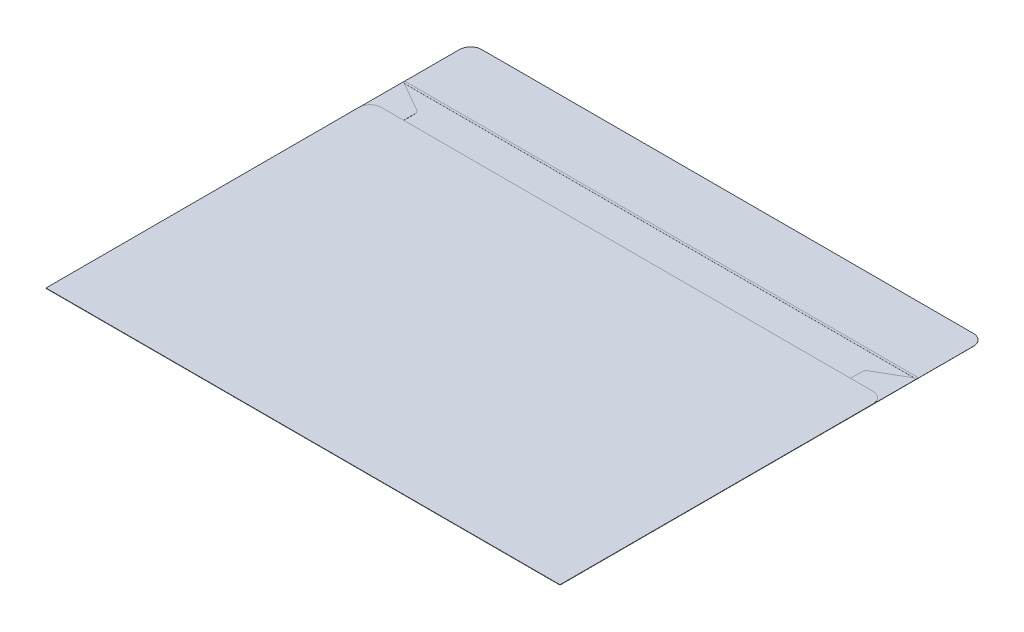
ISO-10303-21;
HEADER;
FILE_DESCRIPTION(('STEP AP214'),'2;1');
FILE_NAME('part.step','',(''),(''),'','','');
FILE_SCHEMA(('AUTOMOTIVE_DESIGN { 1 0 10303 214 1 1 1 1 }'));
ENDSEC;
DATA;
#1=APPLICATION_CONTEXT('core data for automotive mechanical design processes');
#2=APPLICATION_PROTOCOL_DEFINITION('international standard','automotive_design',2000,#1);
#3=PRODUCT_CONTEXT('',#1,'mechanical');
#4=PRODUCT('Part','Part','',(#3));
#5=PRODUCT_RELATED_PRODUCT_CATEGORY('part','',(#4));
#6=PRODUCT_DEFINITION_FORMATION('','',#4);
#7=PRODUCT_DEFINITION_CONTEXT('part definition',#1,'design');
#8=PRODUCT_DEFINITION('design','',#6,#7);
#9=PRODUCT_DEFINITION_SHAPE('','',#8);
#10=(LENGTH_UNIT() NAMED_UNIT(*) SI_UNIT(.MILLI.,.METRE.));
#11=(NAMED_UNIT(*) PLANE_ANGLE_UNIT() SI_UNIT($,.RADIAN.));
#12=(NAMED_UNIT(*) SI_UNIT($,.STERADIAN.) SOLID_ANGLE_UNIT());
#13=UNCERTAINTY_MEASURE_WITH_UNIT(LENGTH_MEASURE(1.E-05),#10,'distance_accuracy_value','');
#14=(GEOMETRIC_REPRESENTATION_CONTEXT(3) GLOBAL_UNCERTAINTY_ASSIGNED_CONTEXT((#13)) GLOBAL_UNIT_ASSIGNED_CONTEXT((#10,
#11,#12)) REPRESENTATION_CONTEXT('',''));
#15=CARTESIAN_POINT('',(0.,0.,0.));
#16=DIRECTION('',(0.,0.,1.));
#17=DIRECTION('',(1.,0.,0.));
#18=AXIS2_PLACEMENT_3D('',#15,#16,#17);
#19=CARTESIAN_POINT('',(-110.,0.05,-105.));
#20=DIRECTION('',(0.,1.,0.));
#21=DIRECTION('',(0.,0.,1.));
#22=AXIS2_PLACEMENT_3D('',#19,#20,#21);
#23=PLANE('',#22);
#24=DIRECTION('',(1.,0.,0.));
#25=VECTOR('',#24,1.);
#26=CARTESIAN_POINT('',(-110.,0.05,-79.5));
#27=LINE('',#26,#25);
#28=CARTESIAN_POINT('',(-114.133974596216,0.05,-79.5));
#29=VERTEX_POINT('',#28);
#30=CARTESIAN_POINT('',(114.133974596216,0.05,-79.5));
#31=VERTEX_POINT('',#30);
#32=EDGE_CURVE('E258',#29,#31,#27,.T.);
#33=ORIENTED_EDGE('',*,*,#32,.F.);
#34=DIRECTION('',(0.866025403784437,0.,0.500000000000004));
#35=VECTOR('',#34,1.);
#36=CARTESIAN_POINT('',(5.89101615137729,0.05,-10.2035392823942));
#37=LINE('',#36,#35);
#38=CARTESIAN_POINT('',(-101.,0.05,-71.9170962313452));
#39=VERTEX_POINT('',#38);
#40=EDGE_CURVE('E292',#29,#39,#37,.T.);
#41=ORIENTED_EDGE('',*,*,#40,.T.);
#42=CARTESIAN_POINT('',(-102.,0.05,-70.1850454237763));
#43=DIRECTION('',(0.,1.,0.));
#44=DIRECTION('',(0.,0.,1.));
#45=AXIS2_PLACEMENT_3D('',#42,#43,#44);
#46=CIRCLE('',#45,2.);
#47=CARTESIAN_POINT('',(-100.,0.05,-70.1850454237763));
#48=VERTEX_POINT('',#47);
#49=EDGE_CURVE('E11',#39,#48,#46,.F.);
#50=ORIENTED_EDGE('',*,*,#49,.T.);
#51=DIRECTION('',(0.,0.,1.));
#52=VECTOR('',#51,1.);
#53=CARTESIAN_POINT('',(-100.,0.05,0.));
#54=LINE('',#53,#52);
#55=CARTESIAN_POINT('',(-100.,0.05,-65.));
#56=VERTEX_POINT('',#55);
#57=EDGE_CURVE('E288',#48,#56,#54,.T.);
#58=ORIENTED_EDGE('',*,*,#57,.T.);
#59=DIRECTION('',(1.,0.,0.));
#60=VECTOR('',#59,1.);
#61=CARTESIAN_POINT('',(0.,0.05,-65.));
#62=LINE('',#61,#60);
#63=CARTESIAN_POINT('',(100.,0.05,-65.));
#64=VERTEX_POINT('',#63);
#65=EDGE_CURVE('E308',#56,#64,#62,.T.);
#66=ORIENTED_EDGE('',*,*,#65,.T.);
#67=DIRECTION('',(0.,0.,1.));
#68=VECTOR('',#67,1.);
#69=CARTESIAN_POINT('',(100.,0.05,0.));
#70=LINE('',#69,#68);
#71=CARTESIAN_POINT('',(100.,0.05,-70.1850454237763));
#72=VERTEX_POINT('',#71);
#73=EDGE_CURVE('E272',#72,#64,#70,.T.);
#74=ORIENTED_EDGE('',*,*,#73,.F.);
#75=CARTESIAN_POINT('',(102.,0.05,-70.1850454237763));
#76=DIRECTION('',(0.,1.,0.));
#77=DIRECTION('',(0.,0.,1.));
#78=AXIS2_PLACEMENT_3D('',#75,#76,#77);
#79=CIRCLE('',#78,2.);
#80=CARTESIAN_POINT('',(101.,0.05,-71.9170962313452));
#81=VERTEX_POINT('',#80);
#82=EDGE_CURVE('E43',#72,#81,#79,.F.);
#83=ORIENTED_EDGE('',*,*,#82,.T.);
#84=DIRECTION('',(-0.866025403784437,0.,0.500000000000003));
#85=VECTOR('',#84,1.);
#86=CARTESIAN_POINT('',(-5.89101615137737,0.05,-10.2035392823944));
#87=LINE('',#86,#85);
#88=EDGE_CURVE('E267',#31,#81,#87,.T.);
#89=ORIENTED_EDGE('',*,*,#88,.F.);
#90=EDGE_LOOP('',(#33,#41,#50,#58,#66,#74,#83,#89));
#91=FACE_BOUND('',#90,.T.);
#92=ADVANCED_FACE('F35',(#91),#23,.T.);
#93=CARTESIAN_POINT('',(-110.,0.,-105.));
#94=DIRECTION('',(0.,1.,0.));
#95=DIRECTION('',(0.,0.,1.));
#96=AXIS2_PLACEMENT_3D('',#93,#94,#95);
#97=PLANE('',#96);
#98=DIRECTION('',(0.,0.,1.));
#99=VECTOR('',#98,1.);
#100=CARTESIAN_POINT('',(-115.,0.,-80.));
#101=LINE('',#100,#99);
#102=CARTESIAN_POINT('',(-115.,0.,-79.5));
#103=VERTEX_POINT('',#102);
#104=CARTESIAN_POINT('',(-115.,0.,80.));
#105=VERTEX_POINT('',#104);
#106=EDGE_CURVE('E345',#103,#105,#101,.T.);
#107=ORIENTED_EDGE('',*,*,#106,.F.);
#108=DIRECTION('',(1.,0.,0.));
#109=VECTOR('',#108,1.);
#110=CARTESIAN_POINT('',(-110.,0.,-79.5));
#111=LINE('',#110,#109);
#112=CARTESIAN_POINT('',(115.,0.,-79.5));
#113=VERTEX_POINT('',#112);
#114=EDGE_CURVE('E262',#103,#113,#111,.T.);
#115=ORIENTED_EDGE('',*,*,#114,.T.);
#116=DIRECTION('',(0.,0.,-1.));
#117=VECTOR('',#116,1.);
#118=CARTESIAN_POINT('',(115.,0.,-80.));
#119=LINE('',#118,#117);
#120=CARTESIAN_POINT('',(115.,0.,80.));
#121=VERTEX_POINT('',#120);
#122=EDGE_CURVE('E335',#121,#113,#119,.T.);
#123=ORIENTED_EDGE('',*,*,#122,.F.);
#124=DIRECTION('',(1.,0.,0.));
#125=VECTOR('',#124,1.);
#126=CARTESIAN_POINT('',(-115.,0.,80.));
#127=LINE('',#126,#125);
#128=EDGE_CURVE('E325',#105,#121,#127,.T.);
#129=ORIENTED_EDGE('',*,*,#128,.F.);
#130=EDGE_LOOP('',(#107,#115,#123,#129));
#131=FACE_BOUND('',#130,.T.);
#132=ADVANCED_FACE('F467',(#131),#97,.F.);
#133=DIRECTION('',(-1.,0.,0.));
#134=VECTOR('',#133,1.);
#135=CARTESIAN_POINT('',(-110.,0.05,-80.5));
#136=LINE('',#135,#134);
#137=CARTESIAN_POINT('',(115.,0.05,-80.5));
#138=VERTEX_POINT('',#137);
#139=CARTESIAN_POINT('',(-115.,0.05,-80.5));
#140=VERTEX_POINT('',#139);
#141=EDGE_CURVE('E265',#138,#140,#136,.T.);
#142=ORIENTED_EDGE('',*,*,#141,.F.);
#143=DIRECTION('',(0.,0.,-1.));
#144=VECTOR('',#143,1.);
#145=CARTESIAN_POINT('',(115.,0.05,-80.));
#146=LINE('',#145,#144);
#147=CARTESIAN_POINT('',(115.,0.05,-105.));
#148=VERTEX_POINT('',#147);
#149=EDGE_CURVE('E213',#138,#148,#146,.T.);
#150=ORIENTED_EDGE('',*,*,#149,.T.);
#151=CARTESIAN_POINT('',(110.,0.05,-105.));
#152=DIRECTION('',(0.,1.,0.));
#153=DIRECTION('',(0.,0.,-1.));
#154=AXIS2_PLACEMENT_3D('',#151,#152,#153);
#155=CIRCLE('',#154,5.);
#156=CARTESIAN_POINT('',(110.,0.05,-110.));
#157=VERTEX_POINT('',#156);
#158=EDGE_CURVE('E324',#148,#157,#155,.T.);
#159=ORIENTED_EDGE('',*,*,#158,.T.);
#160=DIRECTION('',(-1.,0.,0.));
#161=VECTOR('',#160,1.);
#162=CARTESIAN_POINT('',(-110.,0.05,-110.));
#163=LINE('',#162,#161);
#164=CARTESIAN_POINT('',(-110.,0.05,-110.));
#165=VERTEX_POINT('',#164);
#166=EDGE_CURVE('E327',#157,#165,#163,.T.);
#167=ORIENTED_EDGE('',*,*,#166,.T.);
#168=CARTESIAN_POINT('',(-110.,0.05,-105.));
#169=DIRECTION('',(0.,1.,0.));
#170=DIRECTION('',(0.,0.,1.));
#171=AXIS2_PLACEMENT_3D('',#168,#169,#170);
#172=CIRCLE('',#171,5.);
#173=CARTESIAN_POINT('',(-115.,0.05,-105.));
#174=VERTEX_POINT('',#173);
#175=EDGE_CURVE('E329',#165,#174,#172,.T.);
#176=ORIENTED_EDGE('',*,*,#175,.T.);
#177=DIRECTION('',(0.,0.,1.));
#178=VECTOR('',#177,1.);
#179=CARTESIAN_POINT('',(-115.,0.05,-80.));
#180=LINE('',#179,#178);
#181=EDGE_CURVE('E331',#174,#140,#180,.T.);
#182=ORIENTED_EDGE('',*,*,#181,.T.);
#183=EDGE_LOOP('',(#142,#150,#159,#167,#176,#182));
#184=FACE_BOUND('',#183,.T.);
#185=ADVANCED_FACE('F494',(#184),#23,.T.);
#186=CARTESIAN_POINT('',(0.,0.15,-65.));
#187=DIRECTION('',(0.,0.,-1.));
#188=DIRECTION('',(-1.,0.,0.));
#189=AXIS2_PLACEMENT_3D('',#186,#187,#188);
#190=PLANE('',#189);
#191=DIRECTION('',(1.,0.,0.));
#192=VECTOR('',#191,1.);
#193=CARTESIAN_POINT('',(0.,0.15,-65.));
#194=LINE('',#193,#192);
#195=CARTESIAN_POINT('',(-110.,0.15,-65.));
#196=VERTEX_POINT('',#195);
#197=CARTESIAN_POINT('',(110.,0.15,-65.));
#198=VERTEX_POINT('',#197);
#199=EDGE_CURVE('E315',#196,#198,#194,.T.);
#200=ORIENTED_EDGE('',*,*,#199,.T.);
#201=DIRECTION('',(0.,-1.,0.));
#202=VECTOR('',#201,1.);
#203=CARTESIAN_POINT('',(110.,0.1,-65.));
#204=LINE('',#203,#202);
#205=CARTESIAN_POINT('',(110.,0.1,-65.));
#206=VERTEX_POINT('',#205);
#207=EDGE_CURVE('E377',#198,#206,#204,.T.);
#208=ORIENTED_EDGE('',*,*,#207,.T.);
#209=DIRECTION('',(1.,0.,0.));
#210=VECTOR('',#209,1.);
#211=CARTESIAN_POINT('',(0.,0.1,-65.));
#212=LINE('',#211,#210);
#213=CARTESIAN_POINT('',(100.,0.1,-65.));
#214=VERTEX_POINT('',#213);
#215=EDGE_CURVE('E277',#214,#206,#212,.T.);
#216=ORIENTED_EDGE('',*,*,#215,.F.);
#217=DIRECTION('',(0.,-1.,0.));
#218=VECTOR('',#217,1.);
#219=CARTESIAN_POINT('',(100.,0.1,-65.));
#220=LINE('',#219,#218);
#221=EDGE_CURVE('E280',#214,#64,#220,.T.);
#222=ORIENTED_EDGE('',*,*,#221,.T.);
#223=ORIENTED_EDGE('',*,*,#65,.F.);
#224=DIRECTION('',(0.,-1.,0.));
#225=VECTOR('',#224,1.);
#226=CARTESIAN_POINT('',(-100.,0.1,-65.));
#227=LINE('',#226,#225);
#228=CARTESIAN_POINT('',(-100.,0.1,-65.));
#229=VERTEX_POINT('',#228);
#230=EDGE_CURVE('E300',#229,#56,#227,.T.);
#231=ORIENTED_EDGE('',*,*,#230,.F.);
#232=DIRECTION('',(1.,0.,0.));
#233=VECTOR('',#232,1.);
#234=CARTESIAN_POINT('',(0.,0.1,-65.));
#235=LINE('',#234,#233);
#236=CARTESIAN_POINT('',(-110.,0.1,-65.));
#237=VERTEX_POINT('',#236);
#238=EDGE_CURVE('E297',#237,#229,#235,.T.);
#239=ORIENTED_EDGE('',*,*,#238,.F.);
#240=DIRECTION('',(0.,-1.,0.));
#241=VECTOR('',#240,1.);
#242=CARTESIAN_POINT('',(-110.,0.15,-65.));
#243=LINE('',#242,#241);
#244=EDGE_CURVE('E375',#237,#196,#243,.F.);
#245=ORIENTED_EDGE('',*,*,#244,.T.);
#246=EDGE_LOOP('',(#200,#208,#216,#222,#223,#231,#239,#245));
#247=FACE_BOUND('',#246,.T.);
#248=ADVANCED_FACE('F426',(#247),#190,.T.);
#249=CARTESIAN_POINT('',(115.,0.05,-80.));
#250=DIRECTION('',(-1.,0.,0.));
#251=DIRECTION('',(0.,0.,1.));
#252=AXIS2_PLACEMENT_3D('',#249,#250,#251);
#253=PLANE('',#252);
#254=DIRECTION('',(0.,0.,-1.));
#255=VECTOR('',#254,1.);
#256=CARTESIAN_POINT('',(115.,0.1,0.));
#257=LINE('',#256,#255);
#258=CARTESIAN_POINT('',(115.,0.1,-60.));
#259=VERTEX_POINT('',#258);
#260=CARTESIAN_POINT('',(115.,0.1,-80.));
#261=VERTEX_POINT('',#260);
#262=EDGE_CURVE('E268',#259,#261,#257,.T.);
#263=ORIENTED_EDGE('',*,*,#262,.F.);
#264=DIRECTION('',(0.,-1.,0.));
#265=VECTOR('',#264,1.);
#266=CARTESIAN_POINT('',(115.,0.15,-60.));
#267=LINE('',#266,#265);
#268=CARTESIAN_POINT('',(115.,0.15,-60.));
#269=VERTEX_POINT('',#268);
#270=EDGE_CURVE('E380',#259,#269,#267,.F.);
#271=ORIENTED_EDGE('',*,*,#270,.T.);
#272=DIRECTION('',(0.,0.,-1.));
#273=VECTOR('',#272,1.);
#274=CARTESIAN_POINT('',(115.,0.15,0.));
#275=LINE('',#274,#273);
#276=CARTESIAN_POINT('',(115.,0.15,80.));
#277=VERTEX_POINT('',#276);
#278=EDGE_CURVE('E312',#277,#269,#275,.T.);
#279=ORIENTED_EDGE('',*,*,#278,.F.);
#280=DIRECTION('',(0.,-1.,0.));
#281=VECTOR('',#280,1.);
#282=CARTESIAN_POINT('',(115.,0.05,80.));
#283=LINE('',#282,#281);
#284=EDGE_CURVE('E334',#277,#121,#283,.T.);
#285=ORIENTED_EDGE('',*,*,#284,.T.);
#286=ORIENTED_EDGE('',*,*,#122,.T.);
#287=DIRECTION('',(0.,1.,0.));
#288=VECTOR('',#287,1.);
#289=CARTESIAN_POINT('',(115.,-0.03,-79.5));
#290=LINE('',#289,#288);
#291=CARTESIAN_POINT('',(115.,-0.03,-79.5));
#292=VERTEX_POINT('',#291);
#293=EDGE_CURVE('E248',#292,#113,#290,.T.);
#294=ORIENTED_EDGE('',*,*,#293,.F.);
#295=DIRECTION('',(0.,0.,-1.));
#296=VECTOR('',#295,1.);
#297=CARTESIAN_POINT('',(115.,-0.03,-80.5));
#298=LINE('',#297,#296);
#299=CARTESIAN_POINT('',(115.,-0.03,-80.5));
#300=VERTEX_POINT('',#299);
#301=EDGE_CURVE('E237',#292,#300,#298,.T.);
#302=ORIENTED_EDGE('',*,*,#301,.T.);
#303=DIRECTION('',(0.,1.,0.));
#304=VECTOR('',#303,1.);
#305=CARTESIAN_POINT('',(115.,-0.03,-80.5));
#306=LINE('',#305,#304);
#307=CARTESIAN_POINT('',(115.,0.,-80.5));
#308=VERTEX_POINT('',#307);
#309=EDGE_CURVE('E217',#300,#308,#306,.T.);
#310=ORIENTED_EDGE('',*,*,#309,.T.);
#311=CARTESIAN_POINT('',(115.,0.,-105.));
#312=VERTEX_POINT('',#311);
#313=EDGE_CURVE('E320',#308,#312,#119,.T.);
#314=ORIENTED_EDGE('',*,*,#313,.T.);
#315=DIRECTION('',(0.,-1.,0.));
#316=VECTOR('',#315,1.);
#317=CARTESIAN_POINT('',(115.,0.05,-105.));
#318=LINE('',#317,#316);
#319=EDGE_CURVE('E365',#148,#312,#318,.T.);
#320=ORIENTED_EDGE('',*,*,#319,.F.);
#321=ORIENTED_EDGE('',*,*,#149,.F.);
#322=CARTESIAN_POINT('',(115.,0.08,-80.5));
#323=VERTEX_POINT('',#322);
#324=EDGE_CURVE('E206',#138,#323,#306,.T.);
#325=ORIENTED_EDGE('',*,*,#324,.T.);
#326=DIRECTION('',(0.,0.,-1.));
#327=VECTOR('',#326,1.);
#328=CARTESIAN_POINT('',(115.,0.08,-80.5));
#329=LINE('',#328,#327);
#330=CARTESIAN_POINT('',(115.,0.08,-80.));
#331=VERTEX_POINT('',#330);
#332=EDGE_CURVE('E210',#331,#323,#329,.T.);
#333=ORIENTED_EDGE('',*,*,#332,.F.);
#334=DIRECTION('',(0.,-1.,0.));
#335=VECTOR('',#334,1.);
#336=CARTESIAN_POINT('',(115.,0.1,-80.));
#337=LINE('',#336,#335);
#338=EDGE_CURVE('E286',#261,#331,#337,.T.);
#339=ORIENTED_EDGE('',*,*,#338,.F.);
#340=EDGE_LOOP('',(#263,#271,#279,#285,#286,#294,#302,#310,#314,#320,#321,#325,#333,#339));
#341=FACE_BOUND('',#340,.T.);
#342=ADVANCED_FACE('F208',(#341),#253,.F.);
#343=CARTESIAN_POINT('',(110.,0.05,-105.));
#344=DIRECTION('',(0.,-1.,0.));
#345=DIRECTION('',(0.,0.,-1.));
#346=AXIS2_PLACEMENT_3D('',#343,#344,#345);
#347=CYLINDRICAL_SURFACE('',#346,5.);
#348=CARTESIAN_POINT('',(110.,0.,-105.));
#349=DIRECTION('',(0.,1.,0.));
#350=DIRECTION('',(0.,0.,-1.));
#351=AXIS2_PLACEMENT_3D('',#348,#349,#350);
#352=CIRCLE('',#351,5.);
#353=CARTESIAN_POINT('',(110.,0.,-110.));
#354=VERTEX_POINT('',#353);
#355=EDGE_CURVE('E338',#312,#354,#352,.T.);
#356=ORIENTED_EDGE('',*,*,#355,.T.);
#357=DIRECTION('',(0.,-1.,0.));
#358=VECTOR('',#357,1.);
#359=CARTESIAN_POINT('',(110.,0.05,-110.));
#360=LINE('',#359,#358);
#361=EDGE_CURVE('E362',#157,#354,#360,.T.);
#362=ORIENTED_EDGE('',*,*,#361,.F.);
#363=ORIENTED_EDGE('',*,*,#158,.F.);
#364=ORIENTED_EDGE('',*,*,#319,.T.);
#365=EDGE_LOOP('',(#356,#362,#363,#364));
#366=FACE_BOUND('',#365,.T.);
#367=ADVANCED_FACE('F486',(#366),#347,.T.);
#368=CARTESIAN_POINT('',(-110.,0.05,-110.));
#369=DIRECTION('',(0.,0.,1.));
#370=DIRECTION('',(1.,0.,0.));
#371=AXIS2_PLACEMENT_3D('',#368,#369,#370);
#372=PLANE('',#371);
#373=DIRECTION('',(-1.,0.,0.));
#374=VECTOR('',#373,1.);
#375=CARTESIAN_POINT('',(-110.,0.,-110.));
#376=LINE('',#375,#374);
#377=CARTESIAN_POINT('',(-110.,0.,-110.));
#378=VERTEX_POINT('',#377);
#379=EDGE_CURVE('E340',#354,#378,#376,.T.);
#380=ORIENTED_EDGE('',*,*,#379,.T.);
#381=DIRECTION('',(0.,-1.,0.));
#382=VECTOR('',#381,1.);
#383=CARTESIAN_POINT('',(-110.,0.05,-110.));
#384=LINE('',#383,#382);
#385=EDGE_CURVE('E359',#165,#378,#384,.T.);
#386=ORIENTED_EDGE('',*,*,#385,.F.);
#387=ORIENTED_EDGE('',*,*,#166,.F.);
#388=ORIENTED_EDGE('',*,*,#361,.T.);
#389=EDGE_LOOP('',(#380,#386,#387,#388));
#390=FACE_BOUND('',#389,.T.);
#391=ADVANCED_FACE('F490',(#390),#372,.F.);
#392=CARTESIAN_POINT('',(-110.,0.05,-105.));
#393=DIRECTION('',(0.,-1.,0.));
#394=DIRECTION('',(0.,0.,-1.));
#395=AXIS2_PLACEMENT_3D('',#392,#393,#394);
#396=CYLINDRICAL_SURFACE('',#395,5.);
#397=CARTESIAN_POINT('',(-110.,0.,-105.));
#398=DIRECTION('',(0.,1.,0.));
#399=DIRECTION('',(0.,0.,1.));
#400=AXIS2_PLACEMENT_3D('',#397,#398,#399);
#401=CIRCLE('',#400,5.);
#402=CARTESIAN_POINT('',(-115.,0.,-105.));
#403=VERTEX_POINT('',#402);
#404=EDGE_CURVE('E342',#378,#403,#401,.T.);
#405=ORIENTED_EDGE('',*,*,#404,.T.);
#406=DIRECTION('',(0.,-1.,0.));
#407=VECTOR('',#406,1.);
#408=CARTESIAN_POINT('',(-115.,0.05,-105.));
#409=LINE('',#408,#407);
#410=EDGE_CURVE('E356',#174,#403,#409,.T.);
#411=ORIENTED_EDGE('',*,*,#410,.F.);
#412=ORIENTED_EDGE('',*,*,#175,.F.);
#413=ORIENTED_EDGE('',*,*,#385,.T.);
#414=EDGE_LOOP('',(#405,#411,#412,#413));
#415=FACE_BOUND('',#414,.T.);
#416=ADVANCED_FACE('F608',(#415),#396,.T.);
#417=CARTESIAN_POINT('',(-115.,0.05,-80.));
#418=DIRECTION('',(1.,0.,0.));
#419=DIRECTION('',(0.,0.,-1.));
#420=AXIS2_PLACEMENT_3D('',#417,#418,#419);
#421=PLANE('',#420);
#422=DIRECTION('',(0.,0.,1.));
#423=VECTOR('',#422,1.);
#424=CARTESIAN_POINT('',(-115.,0.15,0.));
#425=LINE('',#424,#423);
#426=CARTESIAN_POINT('',(-115.,0.15,-60.));
#427=VERTEX_POINT('',#426);
#428=CARTESIAN_POINT('',(-115.,0.15,80.));
#429=VERTEX_POINT('',#428);
#430=EDGE_CURVE('E318',#427,#429,#425,.T.);
#431=ORIENTED_EDGE('',*,*,#430,.F.);
#432=DIRECTION('',(0.,-1.,0.));
#433=VECTOR('',#432,1.);
#434=CARTESIAN_POINT('',(-115.,0.1,-60.));
#435=LINE('',#434,#433);
#436=CARTESIAN_POINT('',(-115.,0.1,-60.));
#437=VERTEX_POINT('',#436);
#438=EDGE_CURVE('E386',#427,#437,#435,.T.);
#439=ORIENTED_EDGE('',*,*,#438,.T.);
#440=DIRECTION('',(0.,0.,1.));
#441=VECTOR('',#440,1.);
#442=CARTESIAN_POINT('',(-115.,0.1,0.));
#443=LINE('',#442,#441);
#444=CARTESIAN_POINT('',(-115.,0.1,-80.));
#445=VERTEX_POINT('',#444);
#446=EDGE_CURVE('E295',#445,#437,#443,.T.);
#447=ORIENTED_EDGE('',*,*,#446,.F.);
#448=DIRECTION('',(0.,-1.,0.));
#449=VECTOR('',#448,1.);
#450=CARTESIAN_POINT('',(-115.,0.1,-80.));
#451=LINE('',#450,#449);
#452=CARTESIAN_POINT('',(-115.,0.08,-80.));
#453=VERTEX_POINT('',#452);
#454=EDGE_CURVE('E305',#445,#453,#451,.T.);
#455=ORIENTED_EDGE('',*,*,#454,.T.);
#456=DIRECTION('',(0.,0.,1.));
#457=VECTOR('',#456,1.);
#458=CARTESIAN_POINT('',(-115.,0.08,-80.5));
#459=LINE('',#458,#457);
#460=CARTESIAN_POINT('',(-115.,0.08,-80.5));
#461=VERTEX_POINT('',#460);
#462=EDGE_CURVE('E231',#461,#453,#459,.T.);
#463=ORIENTED_EDGE('',*,*,#462,.F.);
#464=DIRECTION('',(0.,1.,0.));
#465=VECTOR('',#464,1.);
#466=CARTESIAN_POINT('',(-115.,-0.03,-80.5));
#467=LINE('',#466,#465);
#468=EDGE_CURVE('E230',#140,#461,#467,.T.);
#469=ORIENTED_EDGE('',*,*,#468,.F.);
#470=ORIENTED_EDGE('',*,*,#181,.F.);
#471=ORIENTED_EDGE('',*,*,#410,.T.);
#472=CARTESIAN_POINT('',(-115.,0.,-80.5));
#473=VERTEX_POINT('',#472);
#474=EDGE_CURVE('E346',#403,#473,#101,.T.);
#475=ORIENTED_EDGE('',*,*,#474,.T.);
#476=CARTESIAN_POINT('',(-115.,-0.03,-80.5));
#477=VERTEX_POINT('',#476);
#478=EDGE_CURVE('E254',#477,#473,#467,.T.);
#479=ORIENTED_EDGE('',*,*,#478,.F.);
#480=DIRECTION('',(0.,0.,1.));
#481=VECTOR('',#480,1.);
#482=CARTESIAN_POINT('',(-115.,-0.03,-80.5));
#483=LINE('',#482,#481);
#484=CARTESIAN_POINT('',(-115.,-0.03,-79.5));
#485=VERTEX_POINT('',#484);
#486=EDGE_CURVE('E243',#477,#485,#483,.T.);
#487=ORIENTED_EDGE('',*,*,#486,.T.);
#488=DIRECTION('',(0.,1.,0.));
#489=VECTOR('',#488,1.);
#490=CARTESIAN_POINT('',(-115.,-0.03,-79.5));
#491=LINE('',#490,#489);
#492=EDGE_CURVE('E251',#485,#103,#491,.T.);
#493=ORIENTED_EDGE('',*,*,#492,.T.);
#494=ORIENTED_EDGE('',*,*,#106,.T.);
#495=DIRECTION('',(0.,-1.,0.));
#496=VECTOR('',#495,1.);
#497=CARTESIAN_POINT('',(-115.,0.05,80.));
#498=LINE('',#497,#496);
#499=EDGE_CURVE('E353',#429,#105,#498,.T.);
#500=ORIENTED_EDGE('',*,*,#499,.F.);
#501=EDGE_LOOP('',(#431,#439,#447,#455,#463,#469,#470,#471,#475,#479,#487,#493,#494,#500));
#502=FACE_BOUND('',#501,.T.);
#503=ADVANCED_FACE('F443',(#502),#421,.F.);
#504=CARTESIAN_POINT('',(-115.,0.05,80.));
#505=DIRECTION('',(0.,0.,-1.));
#506=DIRECTION('',(-1.,0.,0.));
#507=AXIS2_PLACEMENT_3D('',#504,#505,#506);
#508=PLANE('',#507);
#509=ORIENTED_EDGE('',*,*,#128,.T.);
#510=ORIENTED_EDGE('',*,*,#284,.F.);
#511=DIRECTION('',(1.,0.,0.));
#512=VECTOR('',#511,1.);
#513=CARTESIAN_POINT('',(0.,0.15,80.));
#514=LINE('',#513,#512);
#515=EDGE_CURVE('E309',#429,#277,#514,.T.);
#516=ORIENTED_EDGE('',*,*,#515,.F.);
#517=ORIENTED_EDGE('',*,*,#499,.T.);
#518=EDGE_LOOP('',(#509,#510,#516,#517));
#519=FACE_BOUND('',#518,.T.);
#520=ADVANCED_FACE('F463',(#519),#508,.F.);
#521=ORIENTED_EDGE('',*,*,#313,.F.);
#522=DIRECTION('',(-1.,0.,0.));
#523=VECTOR('',#522,1.);
#524=CARTESIAN_POINT('',(-110.,0.,-80.5));
#525=LINE('',#524,#523);
#526=EDGE_CURVE('E372',#308,#473,#525,.T.);
#527=ORIENTED_EDGE('',*,*,#526,.T.);
#528=ORIENTED_EDGE('',*,*,#474,.F.);
#529=ORIENTED_EDGE('',*,*,#404,.F.);
#530=ORIENTED_EDGE('',*,*,#379,.F.);
#531=ORIENTED_EDGE('',*,*,#355,.F.);
#532=EDGE_LOOP('',(#521,#527,#528,#529,#530,#531));
#533=FACE_BOUND('',#532,.T.);
#534=ADVANCED_FACE('F481',(#533),#97,.F.);
#535=CARTESIAN_POINT('',(0.,0.15,0.));
#536=DIRECTION('',(0.,1.,0.));
#537=DIRECTION('',(0.,0.,1.));
#538=AXIS2_PLACEMENT_3D('',#535,#536,#537);
#539=PLANE('',#538);
#540=ORIENTED_EDGE('',*,*,#278,.T.);
#541=CARTESIAN_POINT('',(110.,0.15,-60.));
#542=DIRECTION('',(0.,1.,0.));
#543=DIRECTION('',(0.,0.,1.));
#544=AXIS2_PLACEMENT_3D('',#541,#542,#543);
#545=CIRCLE('',#544,5.);
#546=EDGE_CURVE('E384',#269,#198,#545,.T.);
#547=ORIENTED_EDGE('',*,*,#546,.T.);
#548=ORIENTED_EDGE('',*,*,#199,.F.);
#549=CARTESIAN_POINT('',(-110.,0.15,-60.));
#550=DIRECTION('',(0.,1.,0.));
#551=DIRECTION('',(0.,0.,1.));
#552=AXIS2_PLACEMENT_3D('',#549,#550,#551);
#553=CIRCLE('',#552,5.);
#554=EDGE_CURVE('E382',#196,#427,#553,.T.);
#555=ORIENTED_EDGE('',*,*,#554,.T.);
#556=ORIENTED_EDGE('',*,*,#430,.T.);
#557=ORIENTED_EDGE('',*,*,#515,.T.);
#558=EDGE_LOOP('',(#540,#547,#548,#555,#556,#557));
#559=FACE_BOUND('',#558,.T.);
#560=ADVANCED_FACE('F454',(#559),#539,.T.);
#561=CARTESIAN_POINT('',(-100.,0.1,0.));
#562=DIRECTION('',(1.,0.,0.));
#563=DIRECTION('',(0.,0.,-1.));
#564=AXIS2_PLACEMENT_3D('',#561,#562,#563);
#565=PLANE('',#564);
#566=ORIENTED_EDGE('',*,*,#57,.F.);
#567=DIRECTION('',(0.,-1.,0.));
#568=VECTOR('',#567,1.);
#569=CARTESIAN_POINT('',(-100.,0.1,-70.1850454237763));
#570=LINE('',#569,#568);
#571=CARTESIAN_POINT('',(-100.,0.1,-70.1850454237763));
#572=VERTEX_POINT('',#571);
#573=EDGE_CURVE('E50',#48,#572,#570,.F.);
#574=ORIENTED_EDGE('',*,*,#573,.T.);
#575=DIRECTION('',(0.,0.,1.));
#576=VECTOR('',#575,1.);
#577=CARTESIAN_POINT('',(-100.,0.1,0.));
#578=LINE('',#577,#576);
#579=EDGE_CURVE('E289',#572,#229,#578,.T.);
#580=ORIENTED_EDGE('',*,*,#579,.T.);
#581=ORIENTED_EDGE('',*,*,#230,.T.);
#582=EDGE_LOOP('',(#566,#574,#580,#581));
#583=FACE_BOUND('',#582,.T.);
#584=ADVANCED_FACE('F428',(#583),#565,.T.);
#585=CARTESIAN_POINT('',(5.89101615137729,0.1,-10.2035392823942));
#586=DIRECTION('',(0.500000000000004,0.,-0.866025403784437));
#587=DIRECTION('',(-0.866025403784437,0.,-0.500000000000004));
#588=AXIS2_PLACEMENT_3D('',#585,#586,#587);
#589=PLANE('',#588);
#590=DIRECTION('',(0.866025403784437,0.,0.500000000000004));
#591=VECTOR('',#590,1.);
#592=CARTESIAN_POINT('',(5.89101615137729,0.1,-10.2035392823942));
#593=LINE('',#592,#591);
#594=CARTESIAN_POINT('',(-101.,0.1,-71.9170962313452));
#595=VERTEX_POINT('',#594);
#596=EDGE_CURVE('E291',#445,#595,#593,.T.);
#597=ORIENTED_EDGE('',*,*,#596,.T.);
#598=DIRECTION('',(0.,-1.,0.));
#599=VECTOR('',#598,1.);
#600=CARTESIAN_POINT('',(-101.,0.1,-71.9170962313452));
#601=LINE('',#600,#599);
#602=EDGE_CURVE('E401',#595,#39,#601,.T.);
#603=ORIENTED_EDGE('',*,*,#602,.T.);
#604=ORIENTED_EDGE('',*,*,#40,.F.);
#605=DIRECTION('',(0.,-1.,0.));
#606=VECTOR('',#605,1.);
#607=CARTESIAN_POINT('',(-114.133974596216,0.1,-79.5));
#608=LINE('',#607,#606);
#609=CARTESIAN_POINT('',(-114.133974596216,0.08,-79.5));
#610=VERTEX_POINT('',#609);
#611=EDGE_CURVE('E260',#610,#29,#608,.T.);
#612=ORIENTED_EDGE('',*,*,#611,.F.);
#613=DIRECTION('',(0.866025403784437,0.,0.500000000000004));
#614=VECTOR('',#613,1.);
#615=CARTESIAN_POINT('',(5.89101615137729,0.08,-10.2035392823942));
#616=LINE('',#615,#614);
#617=EDGE_CURVE('E250',#453,#610,#616,.T.);
#618=ORIENTED_EDGE('',*,*,#617,.F.);
#619=ORIENTED_EDGE('',*,*,#454,.F.);
#620=EDGE_LOOP('',(#597,#603,#604,#612,#618,#619));
#621=FACE_BOUND('',#620,.T.);
#622=ADVANCED_FACE('F436',(#621),#589,.T.);
#623=CARTESIAN_POINT('',(0.,0.1,0.));
#624=DIRECTION('',(0.,1.,0.));
#625=DIRECTION('',(0.,0.,1.));
#626=AXIS2_PLACEMENT_3D('',#623,#624,#625);
#627=PLANE('',#626);
#628=ORIENTED_EDGE('',*,*,#579,.F.);
#629=CARTESIAN_POINT('',(-102.,0.1,-70.1850454237763));
#630=DIRECTION('',(0.,1.,0.));
#631=DIRECTION('',(0.,0.,1.));
#632=AXIS2_PLACEMENT_3D('',#629,#630,#631);
#633=CIRCLE('',#632,2.);
#634=EDGE_CURVE('E405',#572,#595,#633,.T.);
#635=ORIENTED_EDGE('',*,*,#634,.T.);
#636=ORIENTED_EDGE('',*,*,#596,.F.);
#637=ORIENTED_EDGE('',*,*,#446,.T.);
#638=CARTESIAN_POINT('',(-110.,0.1,-60.));
#639=DIRECTION('',(0.,1.,0.));
#640=DIRECTION('',(0.,0.,1.));
#641=AXIS2_PLACEMENT_3D('',#638,#639,#640);
#642=CIRCLE('',#641,5.);
#643=EDGE_CURVE('E392',#437,#237,#642,.F.);
#644=ORIENTED_EDGE('',*,*,#643,.T.);
#645=ORIENTED_EDGE('',*,*,#238,.T.);
#646=EDGE_LOOP('',(#628,#635,#636,#637,#644,#645));
#647=FACE_BOUND('',#646,.T.);
#648=ADVANCED_FACE('F434',(#647),#627,.T.);
#649=CARTESIAN_POINT('',(-5.89101615137737,0.1,-10.2035392823944));
#650=DIRECTION('',(0.500000000000003,0.,0.866025403784437));
#651=DIRECTION('',(0.866025403784437,0.,-0.500000000000003));
#652=AXIS2_PLACEMENT_3D('',#649,#650,#651);
#653=PLANE('',#652);
#654=ORIENTED_EDGE('',*,*,#88,.T.);
#655=DIRECTION('',(0.,-1.,0.));
#656=VECTOR('',#655,1.);
#657=CARTESIAN_POINT('',(101.,0.1,-71.9170962313452));
#658=LINE('',#657,#656);
#659=CARTESIAN_POINT('',(101.,0.1,-71.9170962313452));
#660=VERTEX_POINT('',#659);
#661=EDGE_CURVE('E397',#81,#660,#658,.F.);
#662=ORIENTED_EDGE('',*,*,#661,.T.);
#663=DIRECTION('',(-0.866025403784437,0.,0.500000000000003));
#664=VECTOR('',#663,1.);
#665=CARTESIAN_POINT('',(-5.89101615137737,0.1,-10.2035392823944));
#666=LINE('',#665,#664);
#667=EDGE_CURVE('E271',#261,#660,#666,.T.);
#668=ORIENTED_EDGE('',*,*,#667,.F.);
#669=ORIENTED_EDGE('',*,*,#338,.T.);
#670=DIRECTION('',(-0.866025403784437,0.,0.500000000000003));
#671=VECTOR('',#670,1.);
#672=CARTESIAN_POINT('',(-5.89101615137737,0.08,-10.2035392823944));
#673=LINE('',#672,#671);
#674=CARTESIAN_POINT('',(114.133974596216,0.08,-79.5));
#675=VERTEX_POINT('',#674);
#676=EDGE_CURVE('E226',#331,#675,#673,.T.);
#677=ORIENTED_EDGE('',*,*,#676,.T.);
#678=DIRECTION('',(0.,-1.,0.));
#679=VECTOR('',#678,1.);
#680=CARTESIAN_POINT('',(114.133974596216,0.1,-79.5));
#681=LINE('',#680,#679);
#682=EDGE_CURVE('E369',#675,#31,#681,.T.);
#683=ORIENTED_EDGE('',*,*,#682,.T.);
#684=EDGE_LOOP('',(#654,#662,#668,#669,#677,#683));
#685=FACE_BOUND('',#684,.T.);
#686=ADVANCED_FACE('F413',(#685),#653,.F.);
#687=CARTESIAN_POINT('',(100.,0.1,0.));
#688=DIRECTION('',(1.,0.,0.));
#689=DIRECTION('',(0.,0.,-1.));
#690=AXIS2_PLACEMENT_3D('',#687,#688,#689);
#691=PLANE('',#690);
#692=DIRECTION('',(0.,0.,1.));
#693=VECTOR('',#692,1.);
#694=CARTESIAN_POINT('',(100.,0.1,0.));
#695=LINE('',#694,#693);
#696=CARTESIAN_POINT('',(100.,0.1,-70.1850454237763));
#697=VERTEX_POINT('',#696);
#698=EDGE_CURVE('E275',#697,#214,#695,.T.);
#699=ORIENTED_EDGE('',*,*,#698,.F.);
#700=DIRECTION('',(0.,-1.,0.));
#701=VECTOR('',#700,1.);
#702=CARTESIAN_POINT('',(100.,0.1,-70.1850454237763));
#703=LINE('',#702,#701);
#704=EDGE_CURVE('E394',#697,#72,#703,.T.);
#705=ORIENTED_EDGE('',*,*,#704,.T.);
#706=ORIENTED_EDGE('',*,*,#73,.T.);
#707=ORIENTED_EDGE('',*,*,#221,.F.);
#708=EDGE_LOOP('',(#699,#705,#706,#707));
#709=FACE_BOUND('',#708,.T.);
#710=ADVANCED_FACE('F423',(#709),#691,.F.);
#711=CARTESIAN_POINT('',(0.,0.1,0.));
#712=DIRECTION('',(0.,1.,0.));
#713=DIRECTION('',(0.,0.,1.));
#714=AXIS2_PLACEMENT_3D('',#711,#712,#713);
#715=PLANE('',#714);
#716=ORIENTED_EDGE('',*,*,#667,.T.);
#717=CARTESIAN_POINT('',(102.,0.1,-70.1850454237763));
#718=DIRECTION('',(0.,1.,0.));
#719=DIRECTION('',(0.,0.,1.));
#720=AXIS2_PLACEMENT_3D('',#717,#718,#719);
#721=CIRCLE('',#720,2.);
#722=EDGE_CURVE('E399',#660,#697,#721,.T.);
#723=ORIENTED_EDGE('',*,*,#722,.T.);
#724=ORIENTED_EDGE('',*,*,#698,.T.);
#725=ORIENTED_EDGE('',*,*,#215,.T.);
#726=CARTESIAN_POINT('',(110.,0.1,-60.));
#727=DIRECTION('',(0.,1.,0.));
#728=DIRECTION('',(0.,0.,1.));
#729=AXIS2_PLACEMENT_3D('',#726,#727,#728);
#730=CIRCLE('',#729,5.);
#731=EDGE_CURVE('E389',#206,#259,#730,.F.);
#732=ORIENTED_EDGE('',*,*,#731,.T.);
#733=ORIENTED_EDGE('',*,*,#262,.T.);
#734=EDGE_LOOP('',(#716,#723,#724,#725,#732,#733));
#735=FACE_BOUND('',#734,.T.);
#736=ADVANCED_FACE('F419',(#735),#715,.T.);
#737=CARTESIAN_POINT('',(0.,0.08,0.));
#738=DIRECTION('',(0.,1.,0.));
#739=DIRECTION('',(0.,0.,1.));
#740=AXIS2_PLACEMENT_3D('',#737,#738,#739);
#741=PLANE('',#740);
#742=ORIENTED_EDGE('',*,*,#462,.T.);
#743=ORIENTED_EDGE('',*,*,#617,.T.);
#744=DIRECTION('',(1.,0.,0.));
#745=VECTOR('',#744,1.);
#746=CARTESIAN_POINT('',(-115.,0.08,-79.5));
#747=LINE('',#746,#745);
#748=EDGE_CURVE('E233',#610,#675,#747,.T.);
#749=ORIENTED_EDGE('',*,*,#748,.T.);
#750=ORIENTED_EDGE('',*,*,#676,.F.);
#751=ORIENTED_EDGE('',*,*,#332,.T.);
#752=DIRECTION('',(-1.,0.,0.));
#753=VECTOR('',#752,1.);
#754=CARTESIAN_POINT('',(-115.,0.08,-80.5));
#755=LINE('',#754,#753);
#756=EDGE_CURVE('E223',#323,#461,#755,.T.);
#757=ORIENTED_EDGE('',*,*,#756,.T.);
#758=EDGE_LOOP('',(#742,#743,#749,#750,#751,#757));
#759=FACE_BOUND('',#758,.T.);
#760=ADVANCED_FACE('F222',(#759),#741,.T.);
#761=CARTESIAN_POINT('',(-115.,-0.03,-79.5));
#762=DIRECTION('',(0.,0.,1.));
#763=DIRECTION('',(1.,0.,0.));
#764=AXIS2_PLACEMENT_3D('',#761,#762,#763);
#765=PLANE('',#764);
#766=ORIENTED_EDGE('',*,*,#748,.F.);
#767=ORIENTED_EDGE('',*,*,#611,.T.);
#768=ORIENTED_EDGE('',*,*,#32,.T.);
#769=ORIENTED_EDGE('',*,*,#682,.F.);
#770=EDGE_LOOP('',(#766,#767,#768,#769));
#771=FACE_BOUND('',#770,.T.);
#772=ADVANCED_FACE('F499',(#771),#765,.T.);
#773=CARTESIAN_POINT('',(-115.,-0.03,-80.5));
#774=DIRECTION('',(0.,0.,-1.));
#775=DIRECTION('',(-1.,0.,0.));
#776=AXIS2_PLACEMENT_3D('',#773,#774,#775);
#777=PLANE('',#776);
#778=ORIENTED_EDGE('',*,*,#324,.F.);
#779=ORIENTED_EDGE('',*,*,#141,.T.);
#780=ORIENTED_EDGE('',*,*,#468,.T.);
#781=ORIENTED_EDGE('',*,*,#756,.F.);
#782=EDGE_LOOP('',(#778,#779,#780,#781));
#783=FACE_BOUND('',#782,.T.);
#784=ADVANCED_FACE('F228',(#783),#777,.T.);
#785=ORIENTED_EDGE('',*,*,#526,.F.);
#786=ORIENTED_EDGE('',*,*,#309,.F.);
#787=DIRECTION('',(-1.,0.,0.));
#788=VECTOR('',#787,1.);
#789=CARTESIAN_POINT('',(-115.,-0.03,-80.5));
#790=LINE('',#789,#788);
#791=EDGE_CURVE('E240',#300,#477,#790,.T.);
#792=ORIENTED_EDGE('',*,*,#791,.T.);
#793=ORIENTED_EDGE('',*,*,#478,.T.);
#794=EDGE_LOOP('',(#785,#786,#792,#793));
#795=FACE_BOUND('',#794,.T.);
#796=ADVANCED_FACE('F477',(#795),#777,.T.);
#797=ORIENTED_EDGE('',*,*,#114,.F.);
#798=ORIENTED_EDGE('',*,*,#492,.F.);
#799=DIRECTION('',(1.,0.,0.));
#800=VECTOR('',#799,1.);
#801=CARTESIAN_POINT('',(-115.,-0.03,-79.5));
#802=LINE('',#801,#800);
#803=EDGE_CURVE('E218',#485,#292,#802,.T.);
#804=ORIENTED_EDGE('',*,*,#803,.T.);
#805=ORIENTED_EDGE('',*,*,#293,.T.);
#806=EDGE_LOOP('',(#797,#798,#804,#805));
#807=FACE_BOUND('',#806,.T.);
#808=ADVANCED_FACE('F475',(#807),#765,.T.);
#809=CARTESIAN_POINT('',(0.,-0.03,0.));
#810=DIRECTION('',(0.,1.,0.));
#811=DIRECTION('',(0.,0.,1.));
#812=AXIS2_PLACEMENT_3D('',#809,#810,#811);
#813=PLANE('',#812);
#814=ORIENTED_EDGE('',*,*,#301,.F.);
#815=ORIENTED_EDGE('',*,*,#803,.F.);
#816=ORIENTED_EDGE('',*,*,#486,.F.);
#817=ORIENTED_EDGE('',*,*,#791,.F.);
#818=EDGE_LOOP('',(#814,#815,#816,#817));
#819=FACE_BOUND('',#818,.T.);
#820=ADVANCED_FACE('F473',(#819),#813,.F.);
#821=CARTESIAN_POINT('',(110.,0.15,-60.));
#822=DIRECTION('',(0.,1.,0.));
#823=DIRECTION('',(0.,0.,1.));
#824=AXIS2_PLACEMENT_3D('',#821,#822,#823);
#825=CYLINDRICAL_SURFACE('',#824,5.);
#826=ORIENTED_EDGE('',*,*,#546,.F.);
#827=ORIENTED_EDGE('',*,*,#270,.F.);
#828=ORIENTED_EDGE('',*,*,#731,.F.);
#829=ORIENTED_EDGE('',*,*,#207,.F.);
#830=EDGE_LOOP('',(#826,#827,#828,#829));
#831=FACE_BOUND('',#830,.T.);
#832=ADVANCED_FACE('F459',(#831),#825,.T.);
#833=CARTESIAN_POINT('',(-110.,0.05,-60.));
#834=DIRECTION('',(0.,1.,0.));
#835=DIRECTION('',(0.,0.,1.));
#836=AXIS2_PLACEMENT_3D('',#833,#834,#835);
#837=CYLINDRICAL_SURFACE('',#836,5.);
#838=ORIENTED_EDGE('',*,*,#554,.F.);
#839=ORIENTED_EDGE('',*,*,#244,.F.);
#840=ORIENTED_EDGE('',*,*,#643,.F.);
#841=ORIENTED_EDGE('',*,*,#438,.F.);
#842=EDGE_LOOP('',(#838,#839,#840,#841));
#843=FACE_BOUND('',#842,.T.);
#844=ADVANCED_FACE('F450',(#843),#837,.T.);
#845=CARTESIAN_POINT('',(102.,0.1,-70.1850454237763));
#846=DIRECTION('',(0.,-1.,0.));
#847=DIRECTION('',(0.,0.,-1.));
#848=AXIS2_PLACEMENT_3D('',#845,#846,#847);
#849=CYLINDRICAL_SURFACE('',#848,2.);
#850=ORIENTED_EDGE('',*,*,#722,.F.);
#851=ORIENTED_EDGE('',*,*,#661,.F.);
#852=ORIENTED_EDGE('',*,*,#82,.F.);
#853=ORIENTED_EDGE('',*,*,#704,.F.);
#854=EDGE_LOOP('',(#850,#851,#852,#853));
#855=FACE_BOUND('',#854,.T.);
#856=ADVANCED_FACE('F416',(#855),#849,.T.);
#857=CARTESIAN_POINT('',(-102.,0.1,-70.1850454237763));
#858=DIRECTION('',(0.,-1.,0.));
#859=DIRECTION('',(0.,0.,-1.));
#860=AXIS2_PLACEMENT_3D('',#857,#858,#859);
#861=CYLINDRICAL_SURFACE('',#860,2.);
#862=ORIENTED_EDGE('',*,*,#634,.F.);
#863=ORIENTED_EDGE('',*,*,#573,.F.);
#864=ORIENTED_EDGE('',*,*,#49,.F.);
#865=ORIENTED_EDGE('',*,*,#602,.F.);
#866=EDGE_LOOP('',(#862,#863,#864,#865));
#867=FACE_BOUND('',#866,.T.);
#868=ADVANCED_FACE('F37',(#867),#861,.T.);
#869=CLOSED_SHELL('',(#92,#132,#185,#248,#342,#367,#391,#416,#503,#520,#534,#560,#584,#622,#648,
#686,#710,#736,#760,#772,#784,#796,#808,#820,#832,#844,#856,#868));
#870=MANIFOLD_SOLID_BREP('B2',#869);
#871=ADVANCED_BREP_SHAPE_REPRESENTATION('',(#18,#870),#14);
#872=SHAPE_DEFINITION_REPRESENTATION(#9,#871);
ENDSEC;
END-ISO-10303-21;
